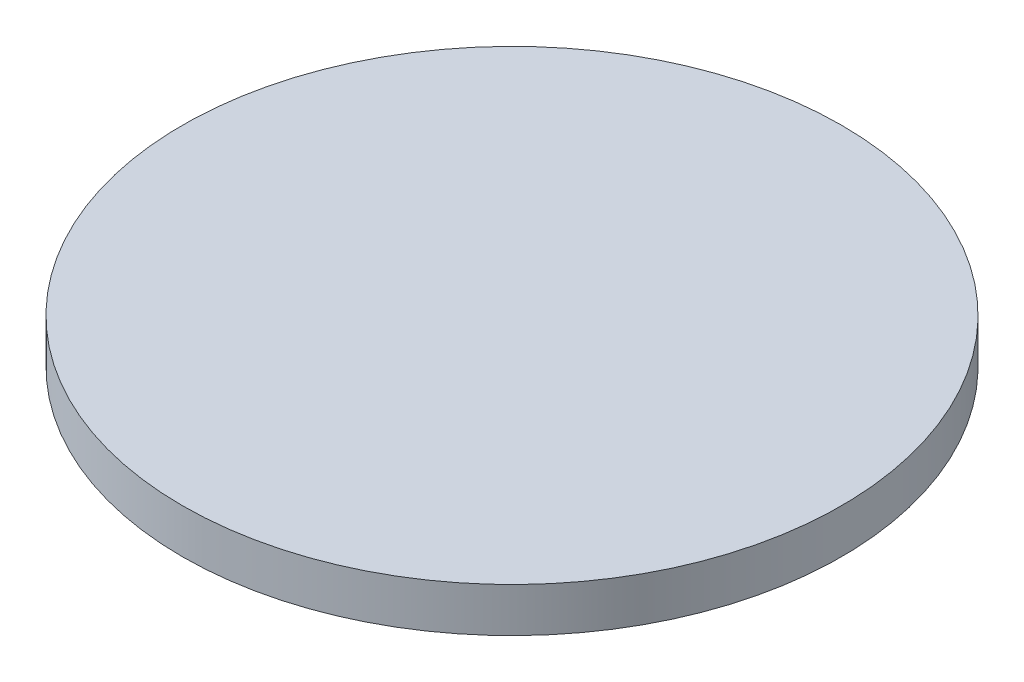
ISO-10303-21;
HEADER;
FILE_DESCRIPTION(('STEP AP214'),'2;1');
FILE_NAME('part.step','',(''),(''),'','','');
FILE_SCHEMA(('AUTOMOTIVE_DESIGN { 1 0 10303 214 1 1 1 1 }'));
ENDSEC;
DATA;
#1=APPLICATION_CONTEXT('core data for automotive mechanical design processes');
#2=APPLICATION_PROTOCOL_DEFINITION('international standard','automotive_design',2000,#1);
#3=PRODUCT_CONTEXT('',#1,'mechanical');
#4=PRODUCT('Part','Part','',(#3));
#5=PRODUCT_RELATED_PRODUCT_CATEGORY('part','',(#4));
#6=PRODUCT_DEFINITION_FORMATION('','',#4);
#7=PRODUCT_DEFINITION_CONTEXT('part definition',#1,'design');
#8=PRODUCT_DEFINITION('design','',#6,#7);
#9=PRODUCT_DEFINITION_SHAPE('','',#8);
#10=(LENGTH_UNIT() NAMED_UNIT(*) SI_UNIT(.MILLI.,.METRE.));
#11=(NAMED_UNIT(*) PLANE_ANGLE_UNIT() SI_UNIT($,.RADIAN.));
#12=(NAMED_UNIT(*) SI_UNIT($,.STERADIAN.) SOLID_ANGLE_UNIT());
#13=UNCERTAINTY_MEASURE_WITH_UNIT(LENGTH_MEASURE(1.E-05),#10,'distance_accuracy_value','');
#14=(GEOMETRIC_REPRESENTATION_CONTEXT(3) GLOBAL_UNCERTAINTY_ASSIGNED_CONTEXT((#13)) GLOBAL_UNIT_ASSIGNED_CONTEXT((#10,
#11,#12)) REPRESENTATION_CONTEXT('',''));
#15=CARTESIAN_POINT('',(0.,0.,0.));
#16=DIRECTION('',(0.,0.,1.));
#17=DIRECTION('',(1.,0.,0.));
#18=AXIS2_PLACEMENT_3D('',#15,#16,#17);
#19=CARTESIAN_POINT('',(0.,4.7,0.));
#20=DIRECTION('',(0.,-1.,0.));
#21=DIRECTION('',(0.,0.,-1.));
#22=AXIS2_PLACEMENT_3D('',#19,#20,#21);
#23=CYLINDRICAL_SURFACE('',#22,35.);
#24=CARTESIAN_POINT('',(0.,4.7,0.));
#25=DIRECTION('',(0.,1.,0.));
#26=DIRECTION('',(0.,0.,1.));
#27=AXIS2_PLACEMENT_3D('',#24,#25,#26);
#28=CIRCLE('',#27,35.);
#29=CARTESIAN_POINT('',(0.,4.7,35.));
#30=VERTEX_POINT('',#29);
#31=EDGE_CURVE('E10',#30,#30,#28,.T.);
#32=ORIENTED_EDGE('',*,*,#31,.F.);
#33=EDGE_LOOP('',(#32));
#34=FACE_BOUND('',#33,.T.);
#35=CARTESIAN_POINT('',(0.,0.,0.));
#36=DIRECTION('',(0.,1.,0.));
#37=DIRECTION('',(0.,0.,1.));
#38=AXIS2_PLACEMENT_3D('',#35,#36,#37);
#39=CIRCLE('',#38,35.);
#40=CARTESIAN_POINT('',(0.,0.,35.));
#41=VERTEX_POINT('',#40);
#42=EDGE_CURVE('E34',#41,#41,#39,.T.);
#43=ORIENTED_EDGE('',*,*,#42,.T.);
#44=EDGE_LOOP('',(#43));
#45=FACE_BOUND('',#44,.T.);
#46=ADVANCED_FACE('F31',(#34,#45),#23,.T.);
#47=CARTESIAN_POINT('',(0.,4.7,0.));
#48=DIRECTION('',(0.,1.,0.));
#49=DIRECTION('',(0.,0.,1.));
#50=AXIS2_PLACEMENT_3D('',#47,#48,#49);
#51=PLANE('',#50);
#52=ORIENTED_EDGE('',*,*,#31,.T.);
#53=EDGE_LOOP('',(#52));
#54=FACE_BOUND('',#53,.T.);
#55=ADVANCED_FACE('F46',(#54),#51,.T.);
#56=CARTESIAN_POINT('',(0.,0.,0.));
#57=DIRECTION('',(0.,1.,0.));
#58=DIRECTION('',(0.,0.,1.));
#59=AXIS2_PLACEMENT_3D('',#56,#57,#58);
#60=PLANE('',#59);
#61=ORIENTED_EDGE('',*,*,#42,.F.);
#62=EDGE_LOOP('',(#61));
#63=FACE_BOUND('',#62,.T.);
#64=ADVANCED_FACE('F44',(#63),#60,.F.);
#65=CLOSED_SHELL('',(#46,#55,#64));
#66=MANIFOLD_SOLID_BREP('B2',#65);
#67=ADVANCED_BREP_SHAPE_REPRESENTATION('',(#18,#66),#14);
#68=SHAPE_DEFINITION_REPRESENTATION(#9,#67);
ENDSEC;
END-ISO-10303-21;
